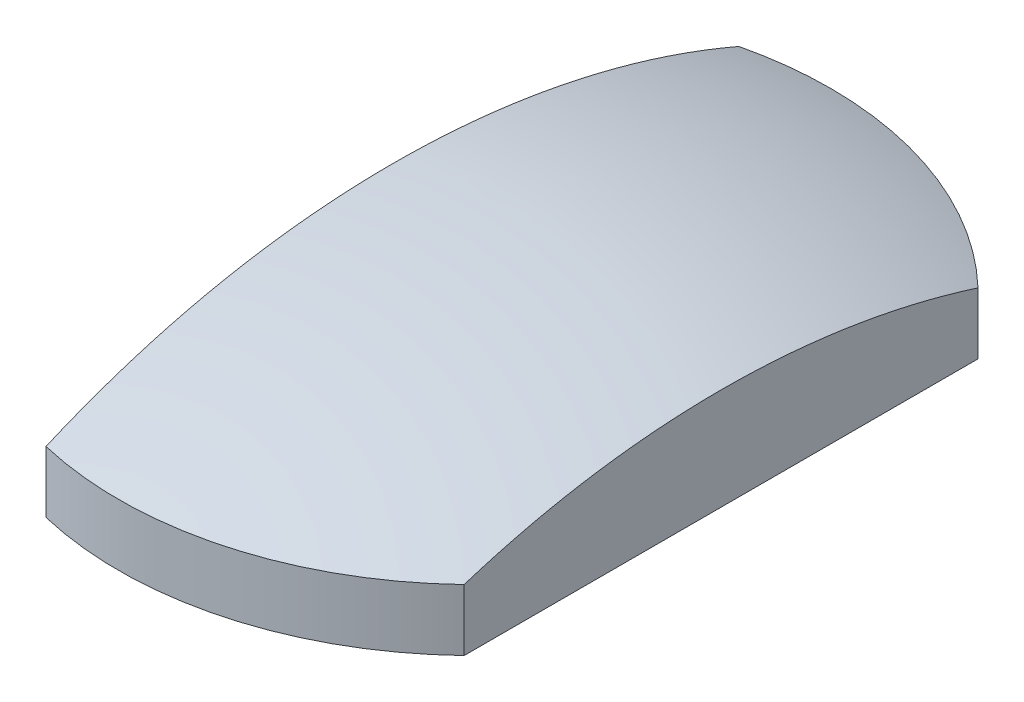
ISO-10303-21;
HEADER;
FILE_DESCRIPTION(('STEP AP214'),'2;1');
FILE_NAME('part.step','',(''),(''),'','','');
FILE_SCHEMA(('AUTOMOTIVE_DESIGN { 1 0 10303 214 1 1 1 1 }'));
ENDSEC;
DATA;
#1=APPLICATION_CONTEXT('core data for automotive mechanical design processes');
#2=APPLICATION_PROTOCOL_DEFINITION('international standard','automotive_design',2000,#1);
#3=PRODUCT_CONTEXT('',#1,'mechanical');
#4=PRODUCT('Part','Part','',(#3));
#5=PRODUCT_RELATED_PRODUCT_CATEGORY('part','',(#4));
#6=PRODUCT_DEFINITION_FORMATION('','',#4);
#7=PRODUCT_DEFINITION_CONTEXT('part definition',#1,'design');
#8=PRODUCT_DEFINITION('design','',#6,#7);
#9=PRODUCT_DEFINITION_SHAPE('','',#8);
#10=(LENGTH_UNIT() NAMED_UNIT(*) SI_UNIT(.MILLI.,.METRE.));
#11=(NAMED_UNIT(*) PLANE_ANGLE_UNIT() SI_UNIT($,.RADIAN.));
#12=(NAMED_UNIT(*) SI_UNIT($,.STERADIAN.) SOLID_ANGLE_UNIT());
#13=UNCERTAINTY_MEASURE_WITH_UNIT(LENGTH_MEASURE(1.E-05),#10,'distance_accuracy_value','');
#14=(GEOMETRIC_REPRESENTATION_CONTEXT(3) GLOBAL_UNCERTAINTY_ASSIGNED_CONTEXT((#13)) GLOBAL_UNIT_ASSIGNED_CONTEXT((#10,
#11,#12)) REPRESENTATION_CONTEXT('',''));
#15=CARTESIAN_POINT('',(0.,0.,0.));
#16=DIRECTION('',(0.,0.,1.));
#17=DIRECTION('',(1.,0.,0.));
#18=AXIS2_PLACEMENT_3D('',#15,#16,#17);
#19=CARTESIAN_POINT('',(0.,-24.06,0.));
#20=DIRECTION('',(0.,1.,0.));
#21=DIRECTION('',(0.,0.,-1.));
#22=AXIS2_PLACEMENT_3D('',#19,#20,#21);
#23=SPHERICAL_SURFACE('',#22,32.06);
#24=CARTESIAN_POINT('',(9.00000000000001,-24.06,0.));
#25=DIRECTION('',(1.,0.,0.));
#26=DIRECTION('',(0.,0.,-1.));
#27=AXIS2_PLACEMENT_3D('',#24,#25,#26);
#28=CIRCLE('',#27,30.7708238433747);
#29=CARTESIAN_POINT('',(9.00000000000001,5.2460335084774,-9.38083151964684));
#30=VERTEX_POINT('',#29);
#31=CARTESIAN_POINT('',(9.00000000000001,5.2460335084774,9.38083151964685));
#32=VERTEX_POINT('',#31);
#33=EDGE_CURVE('E76',#30,#32,#28,.T.);
#34=ORIENTED_EDGE('',*,*,#33,.F.);
#35=CARTESIAN_POINT('',(0.,5.2460335084774,0.));
#36=DIRECTION('',(0.,1.,0.));
#37=DIRECTION('',(0.,0.,1.));
#38=AXIS2_PLACEMENT_3D('',#35,#36,#37);
#39=CIRCLE('',#38,13.);
#40=CARTESIAN_POINT('',(-2.99999999999999,5.2460335084774,-12.6491106406735));
#41=VERTEX_POINT('',#40);
#42=EDGE_CURVE('E112',#30,#41,#39,.T.);
#43=ORIENTED_EDGE('',*,*,#42,.T.);
#44=CARTESIAN_POINT('',(-2.99999999999999,-24.06,0.));
#45=DIRECTION('',(1.,0.,0.));
#46=DIRECTION('',(0.,0.,-1.));
#47=AXIS2_PLACEMENT_3D('',#44,#45,#46);
#48=CIRCLE('',#47,31.9193295668941);
#49=CARTESIAN_POINT('',(-2.99999999999999,5.2460335084774,12.6491106406735));
#50=VERTEX_POINT('',#49);
#51=EDGE_CURVE('E116',#41,#50,#48,.T.);
#52=ORIENTED_EDGE('',*,*,#51,.T.);
#53=EDGE_CURVE('E113',#50,#32,#39,.T.);
#54=ORIENTED_EDGE('',*,*,#53,.T.);
#55=EDGE_LOOP('',(#34,#43,#52,#54));
#56=FACE_BOUND('',#55,.T.);
#57=ADVANCED_FACE('F55',(#56),#23,.T.);
#58=CARTESIAN_POINT('',(0.,8.,0.));
#59=DIRECTION('',(0.,1.,0.));
#60=DIRECTION('',(0.,0.,1.));
#61=AXIS2_PLACEMENT_3D('',#58,#59,#60);
#62=CYLINDRICAL_SURFACE('',#61,13.);
#63=DIRECTION('',(0.,1.,0.));
#64=VECTOR('',#63,1.);
#65=CARTESIAN_POINT('',(9.00000000000001,8.,-9.38083151964684));
#66=LINE('',#65,#64);
#67=CARTESIAN_POINT('',(9.00000000000001,3.,-9.38083151964684));
#68=VERTEX_POINT('',#67);
#69=EDGE_CURVE('E62',#68,#30,#66,.T.);
#70=ORIENTED_EDGE('',*,*,#69,.F.);
#71=CARTESIAN_POINT('',(0.,3.,0.));
#72=DIRECTION('',(0.,1.,0.));
#73=DIRECTION('',(0.,0.,1.));
#74=AXIS2_PLACEMENT_3D('',#71,#72,#73);
#75=CIRCLE('',#74,13.);
#76=CARTESIAN_POINT('',(-2.99999999999999,3.,-12.6491106406735));
#77=VERTEX_POINT('',#76);
#78=EDGE_CURVE('E68',#68,#77,#75,.T.);
#79=ORIENTED_EDGE('',*,*,#78,.T.);
#80=DIRECTION('',(0.,1.,0.));
#81=VECTOR('',#80,1.);
#82=CARTESIAN_POINT('',(-2.99999999999999,8.,-12.6491106406735));
#83=LINE('',#82,#81);
#84=EDGE_CURVE('E107',#77,#41,#83,.T.);
#85=ORIENTED_EDGE('',*,*,#84,.T.);
#86=ORIENTED_EDGE('',*,*,#42,.F.);
#87=EDGE_LOOP('',(#70,#79,#85,#86));
#88=FACE_BOUND('',#87,.T.);
#89=ADVANCED_FACE('F125',(#88),#62,.T.);
#90=DIRECTION('',(0.,1.,0.));
#91=VECTOR('',#90,1.);
#92=CARTESIAN_POINT('',(-2.99999999999999,8.,12.6491106406735));
#93=LINE('',#92,#91);
#94=CARTESIAN_POINT('',(-2.99999999999999,3.,12.6491106406735));
#95=VERTEX_POINT('',#94);
#96=EDGE_CURVE('E103',#50,#95,#93,.F.);
#97=ORIENTED_EDGE('',*,*,#96,.T.);
#98=CARTESIAN_POINT('',(0.,3.,0.));
#99=DIRECTION('',(0.,1.,0.));
#100=DIRECTION('',(0.,0.,1.));
#101=AXIS2_PLACEMENT_3D('',#98,#99,#100);
#102=CIRCLE('',#101,13.);
#103=CARTESIAN_POINT('',(9.00000000000001,3.,9.38083151964685));
#104=VERTEX_POINT('',#103);
#105=EDGE_CURVE('E94',#95,#104,#102,.T.);
#106=ORIENTED_EDGE('',*,*,#105,.T.);
#107=DIRECTION('',(0.,1.,0.));
#108=VECTOR('',#107,1.);
#109=CARTESIAN_POINT('',(9.00000000000001,8.,9.38083151964685));
#110=LINE('',#109,#108);
#111=EDGE_CURVE('E101',#32,#104,#110,.F.);
#112=ORIENTED_EDGE('',*,*,#111,.F.);
#113=ORIENTED_EDGE('',*,*,#53,.F.);
#114=EDGE_LOOP('',(#97,#106,#112,#113));
#115=FACE_BOUND('',#114,.T.);
#116=ADVANCED_FACE('F99',(#115),#62,.T.);
#117=CARTESIAN_POINT('',(-2.99999999999999,0.,0.));
#118=DIRECTION('',(1.,0.,0.));
#119=DIRECTION('',(0.,0.,-1.));
#120=AXIS2_PLACEMENT_3D('',#117,#118,#119);
#121=PLANE('',#120);
#122=ORIENTED_EDGE('',*,*,#84,.F.);
#123=DIRECTION('',(0.,0.,1.));
#124=VECTOR('',#123,1.);
#125=CARTESIAN_POINT('',(-2.99999999999999,3.,15.));
#126=LINE('',#125,#124);
#127=EDGE_CURVE('E104',#77,#95,#126,.T.);
#128=ORIENTED_EDGE('',*,*,#127,.T.);
#129=ORIENTED_EDGE('',*,*,#96,.F.);
#130=ORIENTED_EDGE('',*,*,#51,.F.);
#131=EDGE_LOOP('',(#122,#128,#129,#130));
#132=FACE_BOUND('',#131,.T.);
#133=ADVANCED_FACE('F122',(#132),#121,.F.);
#134=CARTESIAN_POINT('',(9.00000000000001,0.,0.));
#135=DIRECTION('',(1.,0.,0.));
#136=DIRECTION('',(0.,0.,-1.));
#137=AXIS2_PLACEMENT_3D('',#134,#135,#136);
#138=PLANE('',#137);
#139=DIRECTION('',(0.,0.,1.));
#140=VECTOR('',#139,1.);
#141=CARTESIAN_POINT('',(9.00000000000001,3.,0.));
#142=LINE('',#141,#140);
#143=EDGE_CURVE('E13',#68,#104,#142,.T.);
#144=ORIENTED_EDGE('',*,*,#143,.F.);
#145=ORIENTED_EDGE('',*,*,#69,.T.);
#146=ORIENTED_EDGE('',*,*,#33,.T.);
#147=ORIENTED_EDGE('',*,*,#111,.T.);
#148=EDGE_LOOP('',(#144,#145,#146,#147));
#149=FACE_BOUND('',#148,.T.);
#150=ADVANCED_FACE('F106',(#149),#138,.T.);
#151=CARTESIAN_POINT('',(-2.99999999999999,3.,15.));
#152=DIRECTION('',(0.,1.,0.));
#153=DIRECTION('',(0.,0.,1.));
#154=AXIS2_PLACEMENT_3D('',#151,#152,#153);
#155=PLANE('',#154);
#156=ORIENTED_EDGE('',*,*,#143,.T.);
#157=ORIENTED_EDGE('',*,*,#105,.F.);
#158=ORIENTED_EDGE('',*,*,#127,.F.);
#159=ORIENTED_EDGE('',*,*,#78,.F.);
#160=EDGE_LOOP('',(#156,#157,#158,#159));
#161=FACE_BOUND('',#160,.T.);
#162=ADVANCED_FACE('F93',(#161),#155,.F.);
#163=CLOSED_SHELL('',(#57,#89,#116,#133,#150,#162));
#164=MANIFOLD_SOLID_BREP('B2',#163);
#165=ADVANCED_BREP_SHAPE_REPRESENTATION('',(#18,#164),#14);
#166=SHAPE_DEFINITION_REPRESENTATION(#9,#165);
ENDSEC;
END-ISO-10303-21;
